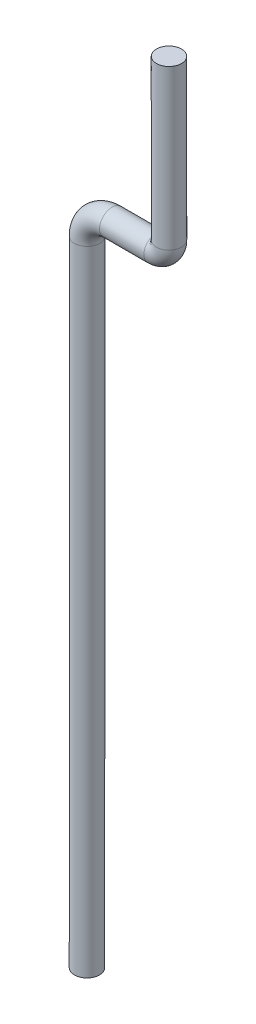
ISO-10303-21;
HEADER;
FILE_DESCRIPTION(('STEP AP214'),'2;1');
FILE_NAME('part.step','',(''),(''),'','','');
FILE_SCHEMA(('AUTOMOTIVE_DESIGN { 1 0 10303 214 1 1 1 1 }'));
ENDSEC;
DATA;
#1=APPLICATION_CONTEXT('core data for automotive mechanical design processes');
#2=APPLICATION_PROTOCOL_DEFINITION('international standard','automotive_design',2000,#1);
#3=PRODUCT_CONTEXT('',#1,'mechanical');
#4=PRODUCT('Part','Part','',(#3));
#5=PRODUCT_RELATED_PRODUCT_CATEGORY('part','',(#4));
#6=PRODUCT_DEFINITION_FORMATION('','',#4);
#7=PRODUCT_DEFINITION_CONTEXT('part definition',#1,'design');
#8=PRODUCT_DEFINITION('design','',#6,#7);
#9=PRODUCT_DEFINITION_SHAPE('','',#8);
#10=(LENGTH_UNIT() NAMED_UNIT(*) SI_UNIT(.MILLI.,.METRE.));
#11=(NAMED_UNIT(*) PLANE_ANGLE_UNIT() SI_UNIT($,.RADIAN.));
#12=(NAMED_UNIT(*) SI_UNIT($,.STERADIAN.) SOLID_ANGLE_UNIT());
#13=UNCERTAINTY_MEASURE_WITH_UNIT(LENGTH_MEASURE(1.E-05),#10,'distance_accuracy_value','');
#14=(GEOMETRIC_REPRESENTATION_CONTEXT(3) GLOBAL_UNCERTAINTY_ASSIGNED_CONTEXT((#13)) GLOBAL_UNIT_ASSIGNED_CONTEXT((#10,
#11,#12)) REPRESENTATION_CONTEXT('',''));
#15=CARTESIAN_POINT('',(0.,0.,0.));
#16=DIRECTION('',(0.,0.,1.));
#17=DIRECTION('',(1.,0.,0.));
#18=AXIS2_PLACEMENT_3D('',#15,#16,#17);
#19=CARTESIAN_POINT('',(10.5430380023108,-4.,0.));
#20=DIRECTION('',(0.,-1.,0.));
#21=DIRECTION('',(0.,0.,-1.));
#22=AXIS2_PLACEMENT_3D('',#19,#20,#21);
#23=PLANE('',#22);
#24=CARTESIAN_POINT('',(10.5430380023108,-4.,0.));
#25=DIRECTION('',(0.,-1.,0.));
#26=DIRECTION('',(0.,0.,-1.));
#27=AXIS2_PLACEMENT_3D('',#24,#25,#26);
#28=CIRCLE('',#27,0.500000000000001);
#29=CARTESIAN_POINT('',(10.5430380023108,-4.,-0.500000000000001));
#30=VERTEX_POINT('',#29);
#31=EDGE_CURVE('E20',#30,#30,#28,.T.);
#32=ORIENTED_EDGE('',*,*,#31,.F.);
#33=EDGE_LOOP('',(#32));
#34=FACE_BOUND('',#33,.T.);
#35=ADVANCED_FACE('F17',(#34),#23,.F.);
#36=CARTESIAN_POINT('',(10.5430380023108,-10.3360911864785,0.));
#37=DIRECTION('',(0.,-1.,0.));
#38=DIRECTION('',(0.,0.,-1.));
#39=AXIS2_PLACEMENT_3D('',#36,#37,#38);
#40=CYLINDRICAL_SURFACE('',#39,0.500000000000001);
#41=ORIENTED_EDGE('',*,*,#31,.T.);
#42=EDGE_LOOP('',(#41));
#43=FACE_BOUND('',#42,.T.);
#44=CARTESIAN_POINT('',(10.5430380023108,-10.3360911865425,0.));
#45=DIRECTION('',(-1.27918886254211E-10,-1.,0.));
#46=DIRECTION('',(1.,-1.27918886254211E-10,0.));
#47=AXIS2_PLACEMENT_3D('',#44,#45,#46);
#48=CIRCLE('',#47,0.500000000000001);
#49=CARTESIAN_POINT('',(10.0430380023108,-10.3360911864785,0.));
#50=VERTEX_POINT('',#49);
#51=CARTESIAN_POINT('',(10.5430380023108,-10.3360911865105,-0.500000000000001));
#52=VERTEX_POINT('',#51);
#53=EDGE_CURVE('E43',#50,#52,#48,.T.);
#54=ORIENTED_EDGE('',*,*,#53,.F.);
#55=CARTESIAN_POINT('',(10.5430380023108,-10.3360911864785,0.));
#56=DIRECTION('',(0.,-1.,0.));
#57=DIRECTION('',(1.,0.,0.));
#58=AXIS2_PLACEMENT_3D('',#55,#56,#57);
#59=CIRCLE('',#58,0.500000000000001);
#60=EDGE_CURVE('E31',#52,#50,#59,.T.);
#61=ORIENTED_EDGE('',*,*,#60,.F.);
#62=EDGE_LOOP('',(#54,#61));
#63=FACE_BOUND('',#62,.T.);
#64=ADVANCED_FACE('F57',(#43,#63),#40,.T.);
#65=CARTESIAN_POINT('',(9.5430380023108,-10.3360911864785,0.));
#66=DIRECTION('',(0.,1.,0.));
#67=DIRECTION('',(-1.,0.,0.));
#68=AXIS2_PLACEMENT_3D('',#65,#66,#67);
#69=CIRCLE('',#68,0.500000000000001);
#70=TRIMMED_CURVE('',#69,(PARAMETER_VALUE(-3.14159265358979)),
(PARAMETER_VALUE(3.14159265358979)),.T.,.PARAMETER.);
#71=CARTESIAN_POINT('',(10.0430380023108,-10.3360911864785,0.));
#72=DIRECTION('',(0.,0.,-1.));
#73=AXIS1_PLACEMENT('',#71,#72);
#74=SURFACE_OF_REVOLUTION('',#70,#73);
#75=CARTESIAN_POINT('',(10.0430380023108,-10.8360911864785,0.));
#76=DIRECTION('',(1.,0.,0.));
#77=DIRECTION('',(0.,0.,-1.));
#78=AXIS2_PLACEMENT_3D('',#75,#76,#77);
#79=CIRCLE('',#78,0.500000000000001);
#80=EDGE_CURVE('E36',#50,#50,#79,.F.);
#81=ORIENTED_EDGE('',*,*,#80,.F.);
#82=ORIENTED_EDGE('',*,*,#53,.T.);
#83=ORIENTED_EDGE('',*,*,#60,.T.);
#84=EDGE_LOOP('',(#81,#82,#83));
#85=FACE_BOUND('',#84,.T.);
#86=ADVANCED_FACE('F64',(#85),#74,.F.);
#87=CARTESIAN_POINT('',(10.0430380023108,-10.8360911864785,0.));
#88=DIRECTION('',(1.,0.,0.));
#89=DIRECTION('',(0.,0.,-1.));
#90=AXIS2_PLACEMENT_3D('',#87,#88,#89);
#91=CYLINDRICAL_SURFACE('',#90,0.500000000000001);
#92=CARTESIAN_POINT('',(8.27776564531535,-10.8360911864785,0.));
#93=DIRECTION('',(-1.,0.,0.));
#94=DIRECTION('',(0.,1.,0.));
#95=AXIS2_PLACEMENT_3D('',#92,#93,#94);
#96=CIRCLE('',#95,0.500000000000001);
#97=CARTESIAN_POINT('',(8.27776564531535,-10.3360911864785,0.));
#98=VERTEX_POINT('',#97);
#99=EDGE_CURVE('E39',#98,#98,#96,.T.);
#100=ORIENTED_EDGE('',*,*,#99,.F.);
#101=EDGE_LOOP('',(#100));
#102=FACE_BOUND('',#101,.T.);
#103=ORIENTED_EDGE('',*,*,#80,.T.);
#104=EDGE_LOOP('',(#103));
#105=FACE_BOUND('',#104,.T.);
#106=ADVANCED_FACE('F37',(#102,#105),#91,.T.);
#107=CARTESIAN_POINT('',(8.27776564531535,-11.8360911864785,0.));
#108=DIRECTION('',(0.,0.,1.));
#109=DIRECTION('',(1.,0.,0.));
#110=AXIS2_PLACEMENT_3D('',#107,#108,#109);
#111=TOROIDAL_SURFACE('',#110,1.,0.500000000000001);
#112=CARTESIAN_POINT('',(7.27776564531534,-11.8360911864785,0.));
#113=DIRECTION('',(0.,1.,0.));
#114=DIRECTION('',(0.,0.,1.));
#115=AXIS2_PLACEMENT_3D('',#112,#113,#114);
#116=CIRCLE('',#115,0.500000000000001);
#117=CARTESIAN_POINT('',(7.27776564531534,-11.8360911864785,0.500000000000001));
#118=VERTEX_POINT('',#117);
#119=EDGE_CURVE('E25',#118,#118,#116,.F.);
#120=ORIENTED_EDGE('',*,*,#119,.F.);
#121=EDGE_LOOP('',(#120));
#122=FACE_BOUND('',#121,.T.);
#123=ORIENTED_EDGE('',*,*,#99,.T.);
#124=EDGE_LOOP('',(#123));
#125=FACE_BOUND('',#124,.T.);
#126=ADVANCED_FACE('F73',(#122,#125),#111,.T.);
#127=CARTESIAN_POINT('',(7.27776564531534,-37.0612,0.));
#128=DIRECTION('',(0.,-1.,0.));
#129=DIRECTION('',(0.,0.,-1.));
#130=AXIS2_PLACEMENT_3D('',#127,#128,#129);
#131=PLANE('',#130);
#132=CARTESIAN_POINT('',(7.27776564531534,-37.0612,0.));
#133=DIRECTION('',(0.,1.,0.));
#134=DIRECTION('',(0.,0.,1.));
#135=AXIS2_PLACEMENT_3D('',#132,#133,#134);
#136=CIRCLE('',#135,0.500000000000001);
#137=CARTESIAN_POINT('',(7.27776564531534,-37.0612,0.500000000000001));
#138=VERTEX_POINT('',#137);
#139=EDGE_CURVE('E11',#138,#138,#136,.T.);
#140=ORIENTED_EDGE('',*,*,#139,.F.);
#141=EDGE_LOOP('',(#140));
#142=FACE_BOUND('',#141,.T.);
#143=ADVANCED_FACE('F67',(#142),#131,.T.);
#144=CARTESIAN_POINT('',(7.27776564531534,-11.8360911864785,0.));
#145=DIRECTION('',(0.,1.,0.));
#146=DIRECTION('',(0.,0.,1.));
#147=AXIS2_PLACEMENT_3D('',#144,#145,#146);
#148=CYLINDRICAL_SURFACE('',#147,0.500000000000001);
#149=ORIENTED_EDGE('',*,*,#139,.T.);
#150=EDGE_LOOP('',(#149));
#151=FACE_BOUND('',#150,.T.);
#152=ORIENTED_EDGE('',*,*,#119,.T.);
#153=EDGE_LOOP('',(#152));
#154=FACE_BOUND('',#153,.T.);
#155=ADVANCED_FACE('F65',(#151,#154),#148,.T.);
#156=CLOSED_SHELL('',(#35,#64,#86,#106,#126,#143,#155));
#157=MANIFOLD_SOLID_BREP('B1',#156);
#158=ADVANCED_BREP_SHAPE_REPRESENTATION('',(#18,#157),#14);
#159=SHAPE_DEFINITION_REPRESENTATION(#9,#158);
ENDSEC;
END-ISO-10303-21;
